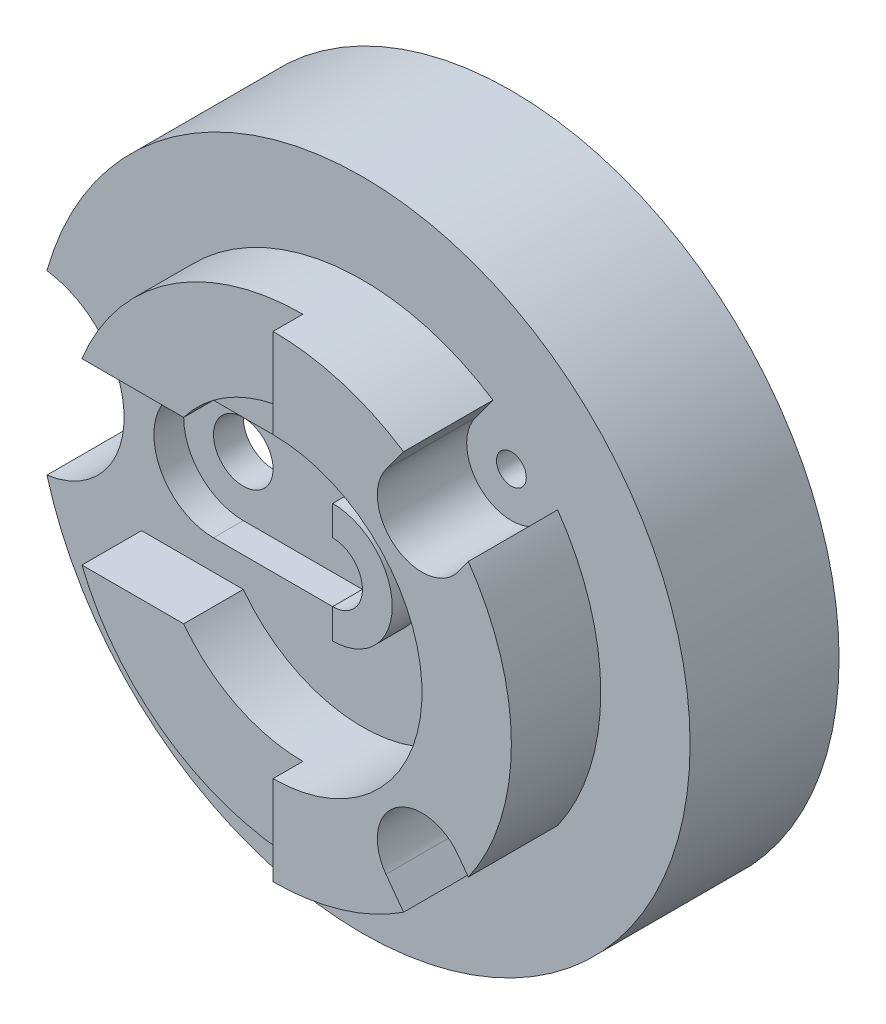
ISO-10303-21;
HEADER;
FILE_DESCRIPTION(('STEP AP214'),'2;1');
FILE_NAME('part.step','',(''),(''),'','','');
FILE_SCHEMA(('AUTOMOTIVE_DESIGN { 1 0 10303 214 1 1 1 1 }'));
ENDSEC;
DATA;
#1=APPLICATION_CONTEXT('core data for automotive mechanical design processes');
#2=APPLICATION_PROTOCOL_DEFINITION('international standard','automotive_design',2000,#1);
#3=PRODUCT_CONTEXT('',#1,'mechanical');
#4=PRODUCT('Part','Part','',(#3));
#5=PRODUCT_RELATED_PRODUCT_CATEGORY('part','',(#4));
#6=PRODUCT_DEFINITION_FORMATION('','',#4);
#7=PRODUCT_DEFINITION_CONTEXT('part definition',#1,'design');
#8=PRODUCT_DEFINITION('design','',#6,#7);
#9=PRODUCT_DEFINITION_SHAPE('','',#8);
#10=(LENGTH_UNIT() NAMED_UNIT(*) SI_UNIT(.MILLI.,.METRE.));
#11=(NAMED_UNIT(*) PLANE_ANGLE_UNIT() SI_UNIT($,.RADIAN.));
#12=(NAMED_UNIT(*) SI_UNIT($,.STERADIAN.) SOLID_ANGLE_UNIT());
#13=UNCERTAINTY_MEASURE_WITH_UNIT(LENGTH_MEASURE(1.E-05),#10,'distance_accuracy_value','');
#14=(GEOMETRIC_REPRESENTATION_CONTEXT(3) GLOBAL_UNCERTAINTY_ASSIGNED_CONTEXT((#13)) GLOBAL_UNIT_ASSIGNED_CONTEXT((#10,
#11,#12)) REPRESENTATION_CONTEXT('',''));
#15=CARTESIAN_POINT('',(0.,0.,0.));
#16=DIRECTION('',(0.,0.,1.));
#17=DIRECTION('',(1.,0.,0.));
#18=AXIS2_PLACEMENT_3D('',#15,#16,#17);
#19=CARTESIAN_POINT('',(0.,0.,70.));
#20=DIRECTION('',(0.,0.,-1.));
#21=DIRECTION('',(-1.,0.,0.));
#22=AXIS2_PLACEMENT_3D('',#19,#20,#21);
#23=CYLINDRICAL_SURFACE('',#22,80.);
#24=DIRECTION('',(0.,0.,1.));
#25=VECTOR('',#24,1.);
#26=CARTESIAN_POINT('',(43.8160478416078,66.9339521583922,50.));
#27=LINE('',#26,#25);
#28=CARTESIAN_POINT('',(43.8160478416078,66.9339521583922,50.));
#29=VERTEX_POINT('',#28);
#30=CARTESIAN_POINT('',(43.8160478416078,66.9339521583922,80.));
#31=VERTEX_POINT('',#30);
#32=EDGE_CURVE('E245',#29,#31,#27,.T.);
#33=ORIENTED_EDGE('',*,*,#32,.F.);
#34=CARTESIAN_POINT('',(0.,0.,50.));
#35=DIRECTION('',(0.,0.,1.));
#36=DIRECTION('',(1.,0.,0.));
#37=AXIS2_PLACEMENT_3D('',#34,#35,#36);
#38=CIRCLE('',#37,80.);
#39=CARTESIAN_POINT('',(-74.1619848709566,30.,50.));
#40=VERTEX_POINT('',#39);
#41=EDGE_CURVE('E232',#29,#40,#38,.T.);
#42=ORIENTED_EDGE('',*,*,#41,.T.);
#43=DIRECTION('',(0.,0.,-1.));
#44=VECTOR('',#43,1.);
#45=CARTESIAN_POINT('',(-74.1619848709566,30.,70.));
#46=LINE('',#45,#44);
#47=CARTESIAN_POINT('',(-74.1619848709566,30.,70.));
#48=VERTEX_POINT('',#47);
#49=EDGE_CURVE('E336',#48,#40,#46,.T.);
#50=ORIENTED_EDGE('',*,*,#49,.F.);
#51=CARTESIAN_POINT('',(0.,0.,70.));
#52=DIRECTION('',(0.,0.,1.));
#53=DIRECTION('',(1.,0.,0.));
#54=AXIS2_PLACEMENT_3D('',#51,#52,#53);
#55=CIRCLE('',#54,80.);
#56=CARTESIAN_POINT('',(0.,80.,70.));
#57=VERTEX_POINT('',#56);
#58=EDGE_CURVE('E323',#57,#48,#55,.T.);
#59=ORIENTED_EDGE('',*,*,#58,.F.);
#60=DIRECTION('',(0.,0.,-1.));
#61=VECTOR('',#60,1.);
#62=CARTESIAN_POINT('',(0.,80.,80.));
#63=LINE('',#62,#61);
#64=CARTESIAN_POINT('',(0.,80.,80.));
#65=VERTEX_POINT('',#64);
#66=EDGE_CURVE('E293',#65,#57,#63,.T.);
#67=ORIENTED_EDGE('',*,*,#66,.F.);
#68=CARTESIAN_POINT('',(0.,0.,80.));
#69=DIRECTION('',(0.,0.,1.));
#70=DIRECTION('',(-1.,0.,0.));
#71=AXIS2_PLACEMENT_3D('',#68,#69,#70);
#72=CIRCLE('',#71,80.);
#73=EDGE_CURVE('E268',#31,#65,#72,.T.);
#74=ORIENTED_EDGE('',*,*,#73,.F.);
#75=EDGE_LOOP('',(#33,#42,#50,#59,#67,#74));
#76=FACE_BOUND('',#75,.T.);
#77=ADVANCED_FACE('F35',(#76),#23,.T.);
#78=CARTESIAN_POINT('',(0.,0.,80.));
#79=DIRECTION('',(0.,0.,-1.));
#80=DIRECTION('',(-1.,0.,0.));
#81=AXIS2_PLACEMENT_3D('',#78,#79,#80);
#82=PLANE('',#81);
#83=DIRECTION('',(0.591291571667573,0.806457858337862,0.));
#84=VECTOR('',#83,1.);
#85=CARTESIAN_POINT('',(-3.42074073833633,2.50807298425605,80.));
#86=LINE('',#85,#84);
#87=CARTESIAN_POINT('',(37.903132124932,58.8693735750136,80.));
#88=VERTEX_POINT('',#87);
#89=EDGE_CURVE('E220',#88,#31,#86,.T.);
#90=ORIENTED_EDGE('',*,*,#89,.T.);
#91=ORIENTED_EDGE('',*,*,#73,.T.);
#92=DIRECTION('',(0.,-1.,0.));
#93=VECTOR('',#92,1.);
#94=CARTESIAN_POINT('',(0.,80.,80.));
#95=LINE('',#94,#93);
#96=CARTESIAN_POINT('',(0.,50.,80.));
#97=VERTEX_POINT('',#96);
#98=EDGE_CURVE('E278',#65,#97,#95,.T.);
#99=ORIENTED_EDGE('',*,*,#98,.T.);
#100=CARTESIAN_POINT('',(0.,0.,80.));
#101=DIRECTION('',(0.,0.,-1.));
#102=DIRECTION('',(-1.,0.,0.));
#103=AXIS2_PLACEMENT_3D('',#100,#101,#102);
#104=CIRCLE('',#103,50.);
#105=CARTESIAN_POINT('',(0.,-50.,80.));
#106=VERTEX_POINT('',#105);
#107=EDGE_CURVE('E281',#97,#106,#104,.T.);
#108=ORIENTED_EDGE('',*,*,#107,.T.);
#109=DIRECTION('',(0.,-1.,0.));
#110=VECTOR('',#109,1.);
#111=CARTESIAN_POINT('',(0.,-50.,80.));
#112=LINE('',#111,#110);
#113=CARTESIAN_POINT('',(0.,-80.,80.));
#114=VERTEX_POINT('',#113);
#115=EDGE_CURVE('E283',#106,#114,#112,.T.);
#116=ORIENTED_EDGE('',*,*,#115,.T.);
#117=CARTESIAN_POINT('',(43.8160478416078,-66.9339521583922,80.));
#118=VERTEX_POINT('',#117);
#119=EDGE_CURVE('E275',#114,#118,#72,.T.);
#120=ORIENTED_EDGE('',*,*,#119,.T.);
#121=DIRECTION('',(0.591291571667574,-0.806457858337862,0.));
#122=VECTOR('',#121,1.);
#123=CARTESIAN_POINT('',(-3.42074073833641,-2.50807298425611,80.));
#124=LINE('',#123,#122);
#125=CARTESIAN_POINT('',(37.903132124932,-58.8693735750136,80.));
#126=VERTEX_POINT('',#125);
#127=EDGE_CURVE('E254',#126,#118,#124,.T.);
#128=ORIENTED_EDGE('',*,*,#127,.F.);
#129=CARTESIAN_POINT('',(50.,-50.,80.));
#130=DIRECTION('',(0.,0.,1.));
#131=DIRECTION('',(1.,0.,0.));
#132=AXIS2_PLACEMENT_3D('',#129,#130,#131);
#133=CIRCLE('',#132,15.);
#134=CARTESIAN_POINT('',(62.0968678750679,-41.1306264249864,80.));
#135=VERTEX_POINT('',#134);
#136=EDGE_CURVE('E262',#135,#126,#133,.T.);
#137=ORIENTED_EDGE('',*,*,#136,.F.);
#138=DIRECTION('',(0.591291571667573,-0.806457858337863,0.));
#139=VECTOR('',#138,1.);
#140=CARTESIAN_POINT('',(20.7729950117996,15.2306741657711,80.));
#141=LINE('',#140,#139);
#142=CARTESIAN_POINT('',(65.5572689246008,-45.8502398155951,80.));
#143=VERTEX_POINT('',#142);
#144=EDGE_CURVE('E58',#135,#143,#141,.T.);
#145=ORIENTED_EDGE('',*,*,#144,.T.);
#146=CARTESIAN_POINT('',(65.5313131174542,45.8873294178488,80.));
#147=VERTEX_POINT('',#146);
#148=EDGE_CURVE('E279',#143,#147,#72,.T.);
#149=ORIENTED_EDGE('',*,*,#148,.T.);
#150=DIRECTION('',(0.591291571667573,0.806457858337862,0.));
#151=VECTOR('',#150,1.);
#152=CARTESIAN_POINT('',(20.7384277813175,-15.2053296151184,80.));
#153=LINE('',#152,#151);
#154=CARTESIAN_POINT('',(61.3922721157812,40.2421244094837,80.));
#155=VERTEX_POINT('',#154);
#156=EDGE_CURVE('E233',#155,#147,#153,.T.);
#157=ORIENTED_EDGE('',*,*,#156,.F.);
#158=CARTESIAN_POINT('',(50.,50.,80.));
#159=DIRECTION('',(0.,0.,1.));
#160=DIRECTION('',(1.,0.,0.));
#161=AXIS2_PLACEMENT_3D('',#158,#159,#160);
#162=CIRCLE('',#161,15.);
#163=EDGE_CURVE('E241',#88,#155,#162,.T.);
#164=ORIENTED_EDGE('',*,*,#163,.F.);
#165=EDGE_LOOP('',(#90,#91,#99,#108,#116,#120,#128,#137,#145,#149,#157,#164));
#166=FACE_BOUND('',#165,.T.);
#167=ADVANCED_FACE('F518',(#166),#82,.F.);
#168=CARTESIAN_POINT('',(65.5572689246008,-45.8502398155951,50.));
#169=VERTEX_POINT('',#168);
#170=CARTESIAN_POINT('',(65.5313131174542,45.8873294178488,50.));
#171=VERTEX_POINT('',#170);
#172=EDGE_CURVE('E332',#169,#171,#38,.T.);
#173=ORIENTED_EDGE('',*,*,#172,.T.);
#174=DIRECTION('',(0.,0.,1.));
#175=VECTOR('',#174,1.);
#176=CARTESIAN_POINT('',(65.5313131174542,45.8873294178488,50.));
#177=LINE('',#176,#175);
#178=EDGE_CURVE('E247',#171,#147,#177,.T.);
#179=ORIENTED_EDGE('',*,*,#178,.T.);
#180=ORIENTED_EDGE('',*,*,#148,.F.);
#181=DIRECTION('',(0.,0.,1.));
#182=VECTOR('',#181,1.);
#183=CARTESIAN_POINT('',(65.5572689246008,-45.8502398155951,50.));
#184=LINE('',#183,#182);
#185=EDGE_CURVE('E266',#169,#143,#184,.T.);
#186=ORIENTED_EDGE('',*,*,#185,.F.);
#187=EDGE_LOOP('',(#173,#179,#180,#186));
#188=FACE_BOUND('',#187,.T.);
#189=ADVANCED_FACE('F462',(#188),#23,.T.);
#190=CARTESIAN_POINT('',(0.,0.,50.));
#191=DIRECTION('',(0.,0.,1.));
#192=DIRECTION('',(1.,0.,0.));
#193=AXIS2_PLACEMENT_3D('',#190,#191,#192);
#194=PLANE('',#193);
#195=CARTESIAN_POINT('',(0.,0.,50.));
#196=DIRECTION('',(0.,0.,1.));
#197=DIRECTION('',(1.,0.,0.));
#198=AXIS2_PLACEMENT_3D('',#195,#196,#197);
#199=CIRCLE('',#198,110.);
#200=CARTESIAN_POINT('',(-105.909090909091,-29.7197655241409,50.));
#201=VERTEX_POINT('',#200);
#202=CARTESIAN_POINT('',(-105.909090909091,29.7197655241409,50.));
#203=VERTEX_POINT('',#202);
#204=EDGE_CURVE('E436',#201,#203,#199,.T.);
#205=ORIENTED_EDGE('',*,*,#204,.T.);
#206=CARTESIAN_POINT('',(-110.,0.,50.));
#207=DIRECTION('',(0.,0.,1.));
#208=DIRECTION('',(1.,0.,0.));
#209=AXIS2_PLACEMENT_3D('',#206,#207,#208);
#210=CIRCLE('',#209,30.);
#211=EDGE_CURVE('E339',#203,#201,#210,.F.);
#212=ORIENTED_EDGE('',*,*,#211,.T.);
#213=EDGE_LOOP('',(#205,#212));
#214=FACE_BOUND('',#213,.T.);
#215=CARTESIAN_POINT('',(35.,0.,50.));
#216=DIRECTION('',(0.,0.,1.));
#217=DIRECTION('',(1.,0.,0.));
#218=AXIS2_PLACEMENT_3D('',#215,#216,#217);
#219=CIRCLE('',#218,5.);
#220=CARTESIAN_POINT('',(40.,0.,50.));
#221=VERTEX_POINT('',#220);
#222=EDGE_CURVE('E412',#221,#221,#219,.T.);
#223=ORIENTED_EDGE('',*,*,#222,.F.);
#224=EDGE_LOOP('',(#223));
#225=FACE_BOUND('',#224,.T.);
#226=DIRECTION('',(1.,0.,0.));
#227=VECTOR('',#226,1.);
#228=CARTESIAN_POINT('',(0.,20.,50.));
#229=LINE('',#228,#227);
#230=CARTESIAN_POINT('',(-50.,20.,50.));
#231=VERTEX_POINT('',#230);
#232=CARTESIAN_POINT('',(0.,20.,50.));
#233=VERTEX_POINT('',#232);
#234=EDGE_CURVE('E402',#231,#233,#229,.T.);
#235=ORIENTED_EDGE('',*,*,#234,.T.);
#236=CARTESIAN_POINT('',(0.,0.,50.));
#237=DIRECTION('',(0.,0.,1.));
#238=DIRECTION('',(1.,0.,0.));
#239=AXIS2_PLACEMENT_3D('',#236,#237,#238);
#240=CIRCLE('',#239,20.);
#241=CARTESIAN_POINT('',(0.,-20.,50.));
#242=VERTEX_POINT('',#241);
#243=EDGE_CURVE('E384',#233,#242,#240,.F.);
#244=ORIENTED_EDGE('',*,*,#243,.T.);
#245=DIRECTION('',(1.,0.,0.));
#246=VECTOR('',#245,1.);
#247=CARTESIAN_POINT('',(0.,-20.,50.));
#248=LINE('',#247,#246);
#249=CARTESIAN_POINT('',(-50.,-20.,50.));
#250=VERTEX_POINT('',#249);
#251=EDGE_CURVE('E389',#250,#242,#248,.T.);
#252=ORIENTED_EDGE('',*,*,#251,.F.);
#253=CARTESIAN_POINT('',(-50.,0.,50.));
#254=DIRECTION('',(0.,0.,1.));
#255=DIRECTION('',(1.,0.,0.));
#256=AXIS2_PLACEMENT_3D('',#253,#254,#255);
#257=CIRCLE('',#256,20.);
#258=EDGE_CURVE('E405',#231,#250,#257,.T.);
#259=ORIENTED_EDGE('',*,*,#258,.F.);
#260=EDGE_LOOP('',(#235,#244,#252,#259));
#261=FACE_BOUND('',#260,.T.);
#262=CARTESIAN_POINT('',(-74.1619848709566,-30.,50.));
#263=VERTEX_POINT('',#262);
#264=CARTESIAN_POINT('',(43.8160478416078,-66.9339521583922,50.));
#265=VERTEX_POINT('',#264);
#266=EDGE_CURVE('E329',#263,#265,#38,.T.);
#267=ORIENTED_EDGE('',*,*,#266,.F.);
#268=DIRECTION('',(-1.,0.,0.));
#269=VECTOR('',#268,1.);
#270=CARTESIAN_POINT('',(-40.,-30.,50.));
#271=LINE('',#270,#269);
#272=CARTESIAN_POINT('',(-40.,-30.,50.));
#273=VERTEX_POINT('',#272);
#274=EDGE_CURVE('E295',#273,#263,#271,.T.);
#275=ORIENTED_EDGE('',*,*,#274,.F.);
#276=CARTESIAN_POINT('',(0.,0.,50.));
#277=DIRECTION('',(0.,0.,-1.));
#278=DIRECTION('',(1.,0.,0.));
#279=AXIS2_PLACEMENT_3D('',#276,#277,#278);
#280=CIRCLE('',#279,50.);
#281=CARTESIAN_POINT('',(-40.,30.,50.));
#282=VERTEX_POINT('',#281);
#283=EDGE_CURVE('E315',#282,#273,#280,.T.);
#284=ORIENTED_EDGE('',*,*,#283,.F.);
#285=DIRECTION('',(1.,0.,0.));
#286=VECTOR('',#285,1.);
#287=CARTESIAN_POINT('',(-74.1619848709566,30.,50.));
#288=LINE('',#287,#286);
#289=EDGE_CURVE('E320',#40,#282,#288,.T.);
#290=ORIENTED_EDGE('',*,*,#289,.F.);
#291=ORIENTED_EDGE('',*,*,#41,.F.);
#292=DIRECTION('',(0.591291571667573,0.806457858337862,0.));
#293=VECTOR('',#292,1.);
#294=CARTESIAN_POINT('',(-3.42074073833633,2.50807298425605,50.));
#295=LINE('',#294,#293);
#296=CARTESIAN_POINT('',(37.903132124932,58.8693735750136,50.));
#297=VERTEX_POINT('',#296);
#298=EDGE_CURVE('E217',#297,#29,#295,.T.);
#299=ORIENTED_EDGE('',*,*,#298,.F.);
#300=CARTESIAN_POINT('',(50.,50.,50.));
#301=DIRECTION('',(0.,0.,1.));
#302=DIRECTION('',(1.,0.,0.));
#303=AXIS2_PLACEMENT_3D('',#300,#301,#302);
#304=CIRCLE('',#303,15.);
#305=CARTESIAN_POINT('',(61.3922721157812,40.2421244094837,50.));
#306=VERTEX_POINT('',#305);
#307=EDGE_CURVE('E230',#297,#306,#304,.T.);
#308=ORIENTED_EDGE('',*,*,#307,.T.);
#309=DIRECTION('',(0.591291571667573,0.806457858337862,0.));
#310=VECTOR('',#309,1.);
#311=CARTESIAN_POINT('',(20.7384277813175,-15.2053296151184,50.));
#312=LINE('',#311,#310);
#313=EDGE_CURVE('E50',#306,#171,#312,.T.);
#314=ORIENTED_EDGE('',*,*,#313,.T.);
#315=ORIENTED_EDGE('',*,*,#172,.F.);
#316=DIRECTION('',(0.591291571667573,-0.806457858337863,0.));
#317=VECTOR('',#316,1.);
#318=CARTESIAN_POINT('',(20.7729950117996,15.2306741657711,50.));
#319=LINE('',#318,#317);
#320=CARTESIAN_POINT('',(62.0968678750679,-41.1306264249864,50.));
#321=VERTEX_POINT('',#320);
#322=EDGE_CURVE('E251',#321,#169,#319,.T.);
#323=ORIENTED_EDGE('',*,*,#322,.F.);
#324=CARTESIAN_POINT('',(50.,-50.,50.));
#325=DIRECTION('',(0.,0.,1.));
#326=DIRECTION('',(1.,0.,0.));
#327=AXIS2_PLACEMENT_3D('',#324,#325,#326);
#328=CIRCLE('',#327,15.);
#329=CARTESIAN_POINT('',(37.903132124932,-58.8693735750136,50.));
#330=VERTEX_POINT('',#329);
#331=EDGE_CURVE('E253',#321,#330,#328,.T.);
#332=ORIENTED_EDGE('',*,*,#331,.T.);
#333=DIRECTION('',(0.591291571667574,-0.806457858337862,0.));
#334=VECTOR('',#333,1.);
#335=CARTESIAN_POINT('',(-3.42074073833641,-2.50807298425611,50.));
#336=LINE('',#335,#334);
#337=EDGE_CURVE('E257',#330,#265,#336,.T.);
#338=ORIENTED_EDGE('',*,*,#337,.T.);
#339=EDGE_LOOP('',(#267,#275,#284,#290,#291,#299,#308,#314,#315,#323,#332,#338));
#340=FACE_BOUND('',#339,.T.);
#341=CARTESIAN_POINT('',(50.,-50.,50.));
#342=DIRECTION('',(0.,0.,1.));
#343=DIRECTION('',(1.,0.,0.));
#344=AXIS2_PLACEMENT_3D('',#341,#342,#343);
#345=CIRCLE('',#344,5.);
#346=CARTESIAN_POINT('',(55.,-50.,50.));
#347=VERTEX_POINT('',#346);
#348=EDGE_CURVE('E624',#347,#347,#345,.T.);
#349=ORIENTED_EDGE('',*,*,#348,.F.);
#350=EDGE_LOOP('',(#349));
#351=FACE_BOUND('',#350,.T.);
#352=CARTESIAN_POINT('',(50.,50.,50.));
#353=DIRECTION('',(0.,0.,1.));
#354=DIRECTION('',(1.,0.,0.));
#355=AXIS2_PLACEMENT_3D('',#352,#353,#354);
#356=CIRCLE('',#355,5.);
#357=CARTESIAN_POINT('',(55.,50.,50.));
#358=VERTEX_POINT('',#357);
#359=EDGE_CURVE('E242',#358,#358,#356,.T.);
#360=ORIENTED_EDGE('',*,*,#359,.F.);
#361=EDGE_LOOP('',(#360));
#362=FACE_BOUND('',#361,.T.);
#363=ADVANCED_FACE('F228',(#214,#225,#261,#340,#351,#362),#194,.T.);
#364=CARTESIAN_POINT('',(0.,0.,50.));
#365=DIRECTION('',(0.,0.,-1.));
#366=DIRECTION('',(-1.,0.,0.));
#367=AXIS2_PLACEMENT_3D('',#364,#365,#366);
#368=CYLINDRICAL_SURFACE('',#367,110.);
#369=CARTESIAN_POINT('',(0.,0.,0.));
#370=DIRECTION('',(0.,0.,1.));
#371=DIRECTION('',(1.,0.,0.));
#372=AXIS2_PLACEMENT_3D('',#369,#370,#371);
#373=CIRCLE('',#372,110.);
#374=CARTESIAN_POINT('',(110.,0.,0.));
#375=VERTEX_POINT('',#374);
#376=EDGE_CURVE('E433',#375,#375,#373,.T.);
#377=ORIENTED_EDGE('',*,*,#376,.T.);
#378=EDGE_LOOP('',(#377));
#379=FACE_BOUND('',#378,.T.);
#380=DIRECTION('',(0.,0.,1.));
#381=VECTOR('',#380,1.);
#382=CARTESIAN_POINT('',(-105.909090909091,29.7197655241409,20.));
#383=LINE('',#382,#381);
#384=CARTESIAN_POINT('',(-105.909090909091,29.7197655241409,20.));
#385=VERTEX_POINT('',#384);
#386=EDGE_CURVE('E347',#385,#203,#383,.T.);
#387=ORIENTED_EDGE('',*,*,#386,.T.);
#388=ORIENTED_EDGE('',*,*,#204,.F.);
#389=DIRECTION('',(0.,0.,1.));
#390=VECTOR('',#389,1.);
#391=CARTESIAN_POINT('',(-105.909090909091,-29.7197655241409,20.));
#392=LINE('',#391,#390);
#393=CARTESIAN_POINT('',(-105.909090909091,-29.7197655241409,20.));
#394=VERTEX_POINT('',#393);
#395=EDGE_CURVE('E350',#394,#201,#392,.T.);
#396=ORIENTED_EDGE('',*,*,#395,.F.);
#397=CARTESIAN_POINT('',(0.,0.,20.));
#398=DIRECTION('',(0.,0.,1.));
#399=DIRECTION('',(1.,0.,0.));
#400=AXIS2_PLACEMENT_3D('',#397,#398,#399);
#401=CIRCLE('',#400,110.);
#402=EDGE_CURVE('E343',#385,#394,#401,.T.);
#403=ORIENTED_EDGE('',*,*,#402,.F.);
#404=EDGE_LOOP('',(#387,#388,#396,#403));
#405=FACE_BOUND('',#404,.T.);
#406=ADVANCED_FACE('F37',(#379,#405),#368,.T.);
#407=CARTESIAN_POINT('',(0.,0.,30.));
#408=DIRECTION('',(0.,0.,-1.));
#409=DIRECTION('',(-1.,0.,0.));
#410=AXIS2_PLACEMENT_3D('',#407,#408,#409);
#411=CYLINDRICAL_SURFACE('',#410,100.);
#412=CARTESIAN_POINT('',(0.,0.,0.));
#413=DIRECTION('',(0.,0.,-1.));
#414=DIRECTION('',(-1.,0.,0.));
#415=AXIS2_PLACEMENT_3D('',#412,#413,#414);
#416=CIRCLE('',#415,100.);
#417=CARTESIAN_POINT('',(-100.,0.,0.));
#418=VERTEX_POINT('',#417);
#419=EDGE_CURVE('E429',#418,#418,#416,.T.);
#420=ORIENTED_EDGE('',*,*,#419,.T.);
#421=EDGE_LOOP('',(#420));
#422=FACE_BOUND('',#421,.T.);
#423=DIRECTION('',(0.,0.,1.));
#424=VECTOR('',#423,1.);
#425=CARTESIAN_POINT('',(-96.3636363636364,26.7217062849074,35.));
#426=LINE('',#425,#424);
#427=CARTESIAN_POINT('',(-96.3636363636364,26.7217062849074,20.));
#428=VERTEX_POINT('',#427);
#429=CARTESIAN_POINT('',(-96.3636363636364,26.7217062849074,30.));
#430=VERTEX_POINT('',#429);
#431=EDGE_CURVE('E356',#428,#430,#426,.T.);
#432=ORIENTED_EDGE('',*,*,#431,.F.);
#433=CARTESIAN_POINT('',(0.,0.,20.));
#434=DIRECTION('',(0.,0.,1.));
#435=DIRECTION('',(1.,0.,0.));
#436=AXIS2_PLACEMENT_3D('',#433,#434,#435);
#437=CIRCLE('',#436,100.);
#438=CARTESIAN_POINT('',(-96.3636363636364,-26.7217062849074,20.));
#439=VERTEX_POINT('',#438);
#440=EDGE_CURVE('E11',#439,#428,#437,.F.);
#441=ORIENTED_EDGE('',*,*,#440,.F.);
#442=DIRECTION('',(0.,0.,1.));
#443=VECTOR('',#442,1.);
#444=CARTESIAN_POINT('',(-96.3636363636364,-26.7217062849074,35.));
#445=LINE('',#444,#443);
#446=CARTESIAN_POINT('',(-96.3636363636364,-26.7217062849074,30.));
#447=VERTEX_POINT('',#446);
#448=EDGE_CURVE('E352',#447,#439,#445,.F.);
#449=ORIENTED_EDGE('',*,*,#448,.F.);
#450=CARTESIAN_POINT('',(0.,0.,30.));
#451=DIRECTION('',(0.,0.,-1.));
#452=DIRECTION('',(-1.,0.,0.));
#453=AXIS2_PLACEMENT_3D('',#450,#451,#452);
#454=CIRCLE('',#453,100.);
#455=EDGE_CURVE('E430',#430,#447,#454,.T.);
#456=ORIENTED_EDGE('',*,*,#455,.F.);
#457=EDGE_LOOP('',(#432,#441,#449,#456));
#458=FACE_BOUND('',#457,.T.);
#459=ADVANCED_FACE('F448',(#422,#458),#411,.F.);
#460=CARTESIAN_POINT('',(0.,0.,30.));
#461=DIRECTION('',(0.,0.,-1.));
#462=DIRECTION('',(-1.,0.,0.));
#463=AXIS2_PLACEMENT_3D('',#460,#461,#462);
#464=PLANE('',#463);
#465=CARTESIAN_POINT('',(50.,-50.,30.));
#466=DIRECTION('',(0.,0.,1.));
#467=DIRECTION('',(1.,0.,0.));
#468=AXIS2_PLACEMENT_3D('',#465,#466,#467);
#469=CIRCLE('',#468,5.);
#470=CARTESIAN_POINT('',(55.,-50.,30.));
#471=VERTEX_POINT('',#470);
#472=EDGE_CURVE('E627',#471,#471,#469,.T.);
#473=ORIENTED_EDGE('',*,*,#472,.T.);
#474=EDGE_LOOP('',(#473));
#475=FACE_BOUND('',#474,.T.);
#476=CARTESIAN_POINT('',(50.,50.,30.));
#477=DIRECTION('',(0.,0.,1.));
#478=DIRECTION('',(1.,0.,0.));
#479=AXIS2_PLACEMENT_3D('',#476,#477,#478);
#480=CIRCLE('',#479,5.);
#481=CARTESIAN_POINT('',(55.,50.,30.));
#482=VERTEX_POINT('',#481);
#483=EDGE_CURVE('E629',#482,#482,#480,.T.);
#484=ORIENTED_EDGE('',*,*,#483,.T.);
#485=EDGE_LOOP('',(#484));
#486=FACE_BOUND('',#485,.T.);
#487=CARTESIAN_POINT('',(0.,0.,30.));
#488=DIRECTION('',(0.,0.,1.));
#489=DIRECTION('',(1.,0.,0.));
#490=AXIS2_PLACEMENT_3D('',#487,#488,#489);
#491=CIRCLE('',#490,10.);
#492=CARTESIAN_POINT('',(10.,0.,30.));
#493=VERTEX_POINT('',#492);
#494=EDGE_CURVE('E426',#493,#493,#491,.T.);
#495=ORIENTED_EDGE('',*,*,#494,.T.);
#496=EDGE_LOOP('',(#495));
#497=FACE_BOUND('',#496,.T.);
#498=CARTESIAN_POINT('',(-50.,0.,30.));
#499=DIRECTION('',(0.,0.,1.));
#500=DIRECTION('',(1.,0.,0.));
#501=AXIS2_PLACEMENT_3D('',#498,#499,#500);
#502=CIRCLE('',#501,10.);
#503=CARTESIAN_POINT('',(-40.,0.,30.));
#504=VERTEX_POINT('',#503);
#505=EDGE_CURVE('E421',#504,#504,#502,.T.);
#506=ORIENTED_EDGE('',*,*,#505,.T.);
#507=EDGE_LOOP('',(#506));
#508=FACE_BOUND('',#507,.T.);
#509=CARTESIAN_POINT('',(35.,0.,30.));
#510=DIRECTION('',(0.,0.,1.));
#511=DIRECTION('',(1.,0.,0.));
#512=AXIS2_PLACEMENT_3D('',#509,#510,#511);
#513=CIRCLE('',#512,5.);
#514=CARTESIAN_POINT('',(40.,0.,30.));
#515=VERTEX_POINT('',#514);
#516=EDGE_CURVE('E418',#515,#515,#513,.T.);
#517=ORIENTED_EDGE('',*,*,#516,.T.);
#518=EDGE_LOOP('',(#517));
#519=FACE_BOUND('',#518,.T.);
#520=ORIENTED_EDGE('',*,*,#455,.T.);
#521=CARTESIAN_POINT('',(-110.,0.,30.));
#522=DIRECTION('',(0.,0.,-1.));
#523=DIRECTION('',(-1.,0.,0.));
#524=AXIS2_PLACEMENT_3D('',#521,#522,#523);
#525=CIRCLE('',#524,30.);
#526=EDGE_CURVE('E43',#447,#430,#525,.F.);
#527=ORIENTED_EDGE('',*,*,#526,.T.);
#528=EDGE_LOOP('',(#520,#527));
#529=FACE_BOUND('',#528,.T.);
#530=ADVANCED_FACE('F443',(#475,#486,#497,#508,#519,#529),#464,.T.);
#531=CARTESIAN_POINT('',(0.,0.,30.));
#532=DIRECTION('',(0.,0.,1.));
#533=DIRECTION('',(1.,0.,0.));
#534=AXIS2_PLACEMENT_3D('',#531,#532,#533);
#535=CYLINDRICAL_SURFACE('',#534,10.);
#536=ORIENTED_EDGE('',*,*,#494,.F.);
#537=EDGE_LOOP('',(#536));
#538=FACE_BOUND('',#537,.T.);
#539=CARTESIAN_POINT('',(0.,0.,40.));
#540=DIRECTION('',(0.,0.,1.));
#541=DIRECTION('',(1.,0.,0.));
#542=AXIS2_PLACEMENT_3D('',#539,#540,#541);
#543=CIRCLE('',#542,10.);
#544=CARTESIAN_POINT('',(0.,-10.,40.));
#545=VERTEX_POINT('',#544);
#546=CARTESIAN_POINT('',(0.,10.,40.));
#547=VERTEX_POINT('',#546);
#548=EDGE_CURVE('E397',#545,#547,#543,.F.);
#549=ORIENTED_EDGE('',*,*,#548,.F.);
#550=DIRECTION('',(0.,0.,-1.));
#551=VECTOR('',#550,1.);
#552=CARTESIAN_POINT('',(0.,-10.,60.));
#553=LINE('',#552,#551);
#554=CARTESIAN_POINT('',(0.,-10.,60.));
#555=VERTEX_POINT('',#554);
#556=EDGE_CURVE('E378',#555,#545,#553,.T.);
#557=ORIENTED_EDGE('',*,*,#556,.F.);
#558=CARTESIAN_POINT('',(0.,0.,60.));
#559=DIRECTION('',(0.,0.,1.));
#560=DIRECTION('',(1.,0.,0.));
#561=AXIS2_PLACEMENT_3D('',#558,#559,#560);
#562=CIRCLE('',#561,10.);
#563=CARTESIAN_POINT('',(0.,10.,60.));
#564=VERTEX_POINT('',#563);
#565=EDGE_CURVE('E362',#564,#555,#562,.F.);
#566=ORIENTED_EDGE('',*,*,#565,.F.);
#567=DIRECTION('',(0.,0.,-1.));
#568=VECTOR('',#567,1.);
#569=CARTESIAN_POINT('',(0.,10.,60.));
#570=LINE('',#569,#568);
#571=EDGE_CURVE('E381',#564,#547,#570,.T.);
#572=ORIENTED_EDGE('',*,*,#571,.T.);
#573=EDGE_LOOP('',(#549,#557,#566,#572));
#574=FACE_BOUND('',#573,.T.);
#575=ADVANCED_FACE('F502',(#538,#574),#535,.F.);
#576=CARTESIAN_POINT('',(-50.,0.,30.));
#577=DIRECTION('',(0.,0.,1.));
#578=DIRECTION('',(1.,0.,0.));
#579=AXIS2_PLACEMENT_3D('',#576,#577,#578);
#580=CYLINDRICAL_SURFACE('',#579,10.);
#581=ORIENTED_EDGE('',*,*,#505,.F.);
#582=EDGE_LOOP('',(#581));
#583=FACE_BOUND('',#582,.T.);
#584=CARTESIAN_POINT('',(-50.,0.,40.));
#585=DIRECTION('',(0.,0.,1.));
#586=DIRECTION('',(1.,0.,0.));
#587=AXIS2_PLACEMENT_3D('',#584,#585,#586);
#588=CIRCLE('',#587,10.);
#589=CARTESIAN_POINT('',(-40.,0.,40.));
#590=VERTEX_POINT('',#589);
#591=EDGE_CURVE('E394',#590,#590,#588,.F.);
#592=ORIENTED_EDGE('',*,*,#591,.F.);
#593=EDGE_LOOP('',(#592));
#594=FACE_BOUND('',#593,.T.);
#595=ADVANCED_FACE('F504',(#583,#594),#580,.F.);
#596=CARTESIAN_POINT('',(0.,0.,0.));
#597=DIRECTION('',(0.,0.,1.));
#598=DIRECTION('',(1.,0.,0.));
#599=AXIS2_PLACEMENT_3D('',#596,#597,#598);
#600=PLANE('',#599);
#601=ORIENTED_EDGE('',*,*,#419,.F.);
#602=EDGE_LOOP('',(#601));
#603=FACE_BOUND('',#602,.T.);
#604=ORIENTED_EDGE('',*,*,#376,.F.);
#605=EDGE_LOOP('',(#604));
#606=FACE_BOUND('',#605,.T.);
#607=ADVANCED_FACE('F511',(#603,#606),#600,.F.);
#608=CARTESIAN_POINT('',(35.,0.,30.));
#609=DIRECTION('',(0.,0.,1.));
#610=DIRECTION('',(1.,0.,0.));
#611=AXIS2_PLACEMENT_3D('',#608,#609,#610);
#612=CYLINDRICAL_SURFACE('',#611,5.);
#613=ORIENTED_EDGE('',*,*,#516,.F.);
#614=EDGE_LOOP('',(#613));
#615=FACE_BOUND('',#614,.T.);
#616=ORIENTED_EDGE('',*,*,#222,.T.);
#617=EDGE_LOOP('',(#616));
#618=FACE_BOUND('',#617,.T.);
#619=ADVANCED_FACE('F645',(#615,#618),#612,.F.);
#620=CARTESIAN_POINT('',(0.,-20.,40.));
#621=DIRECTION('',(0.,-1.,0.));
#622=DIRECTION('',(0.,0.,-1.));
#623=AXIS2_PLACEMENT_3D('',#620,#621,#622);
#624=PLANE('',#623);
#625=ORIENTED_EDGE('',*,*,#251,.T.);
#626=DIRECTION('',(0.,0.,1.));
#627=VECTOR('',#626,1.);
#628=CARTESIAN_POINT('',(0.,-20.,40.));
#629=LINE('',#628,#627);
#630=CARTESIAN_POINT('',(0.,-20.,40.));
#631=VERTEX_POINT('',#630);
#632=EDGE_CURVE('E409',#631,#242,#629,.T.);
#633=ORIENTED_EDGE('',*,*,#632,.F.);
#634=DIRECTION('',(1.,0.,0.));
#635=VECTOR('',#634,1.);
#636=CARTESIAN_POINT('',(0.,-20.,40.));
#637=LINE('',#636,#635);
#638=CARTESIAN_POINT('',(-50.,-20.,40.));
#639=VERTEX_POINT('',#638);
#640=EDGE_CURVE('E392',#639,#631,#637,.T.);
#641=ORIENTED_EDGE('',*,*,#640,.F.);
#642=DIRECTION('',(0.,0.,1.));
#643=VECTOR('',#642,1.);
#644=CARTESIAN_POINT('',(-50.,-20.,40.));
#645=LINE('',#644,#643);
#646=EDGE_CURVE('E413',#639,#250,#645,.T.);
#647=ORIENTED_EDGE('',*,*,#646,.T.);
#648=EDGE_LOOP('',(#625,#633,#641,#647));
#649=FACE_BOUND('',#648,.T.);
#650=ADVANCED_FACE('F491',(#649),#624,.F.);
#651=CARTESIAN_POINT('',(-50.,0.,40.));
#652=DIRECTION('',(0.,0.,1.));
#653=DIRECTION('',(1.,0.,0.));
#654=AXIS2_PLACEMENT_3D('',#651,#652,#653);
#655=CYLINDRICAL_SURFACE('',#654,20.);
#656=ORIENTED_EDGE('',*,*,#258,.T.);
#657=ORIENTED_EDGE('',*,*,#646,.F.);
#658=CARTESIAN_POINT('',(-50.,0.,40.));
#659=DIRECTION('',(0.,0.,1.));
#660=DIRECTION('',(1.,0.,0.));
#661=AXIS2_PLACEMENT_3D('',#658,#659,#660);
#662=CIRCLE('',#661,20.);
#663=CARTESIAN_POINT('',(-50.,20.,40.));
#664=VERTEX_POINT('',#663);
#665=EDGE_CURVE('E388',#664,#639,#662,.T.);
#666=ORIENTED_EDGE('',*,*,#665,.F.);
#667=DIRECTION('',(0.,0.,1.));
#668=VECTOR('',#667,1.);
#669=CARTESIAN_POINT('',(-50.,20.,40.));
#670=LINE('',#669,#668);
#671=EDGE_CURVE('E415',#664,#231,#670,.T.);
#672=ORIENTED_EDGE('',*,*,#671,.T.);
#673=EDGE_LOOP('',(#656,#657,#666,#672));
#674=FACE_BOUND('',#673,.T.);
#675=ADVANCED_FACE('F494',(#674),#655,.F.);
#676=CARTESIAN_POINT('',(0.,20.,40.));
#677=DIRECTION('',(0.,-1.,0.));
#678=DIRECTION('',(0.,0.,-1.));
#679=AXIS2_PLACEMENT_3D('',#676,#677,#678);
#680=PLANE('',#679);
#681=ORIENTED_EDGE('',*,*,#234,.F.);
#682=ORIENTED_EDGE('',*,*,#671,.F.);
#683=DIRECTION('',(1.,0.,0.));
#684=VECTOR('',#683,1.);
#685=CARTESIAN_POINT('',(0.,20.,40.));
#686=LINE('',#685,#684);
#687=CARTESIAN_POINT('',(0.,20.,40.));
#688=VERTEX_POINT('',#687);
#689=EDGE_CURVE('E385',#664,#688,#686,.T.);
#690=ORIENTED_EDGE('',*,*,#689,.T.);
#691=DIRECTION('',(0.,0.,1.));
#692=VECTOR('',#691,1.);
#693=CARTESIAN_POINT('',(0.,20.,40.));
#694=LINE('',#693,#692);
#695=EDGE_CURVE('E399',#688,#233,#694,.T.);
#696=ORIENTED_EDGE('',*,*,#695,.T.);
#697=EDGE_LOOP('',(#681,#682,#690,#696));
#698=FACE_BOUND('',#697,.T.);
#699=ADVANCED_FACE('F496',(#698),#680,.T.);
#700=CARTESIAN_POINT('',(0.,0.,40.));
#701=DIRECTION('',(0.,0.,1.));
#702=DIRECTION('',(1.,0.,0.));
#703=AXIS2_PLACEMENT_3D('',#700,#701,#702);
#704=PLANE('',#703);
#705=DIRECTION('',(0.,1.,0.));
#706=VECTOR('',#705,1.);
#707=CARTESIAN_POINT('',(0.,0.,40.));
#708=LINE('',#707,#706);
#709=EDGE_CURVE('E358',#547,#688,#708,.T.);
#710=ORIENTED_EDGE('',*,*,#709,.T.);
#711=ORIENTED_EDGE('',*,*,#689,.F.);
#712=ORIENTED_EDGE('',*,*,#665,.T.);
#713=ORIENTED_EDGE('',*,*,#640,.T.);
#714=DIRECTION('',(0.,1.,0.));
#715=VECTOR('',#714,1.);
#716=CARTESIAN_POINT('',(0.,0.,40.));
#717=LINE('',#716,#715);
#718=EDGE_CURVE('E363',#631,#545,#717,.T.);
#719=ORIENTED_EDGE('',*,*,#718,.T.);
#720=ORIENTED_EDGE('',*,*,#548,.T.);
#721=EDGE_LOOP('',(#710,#711,#712,#713,#719,#720));
#722=FACE_BOUND('',#721,.T.);
#723=ORIENTED_EDGE('',*,*,#591,.T.);
#724=EDGE_LOOP('',(#723));
#725=FACE_BOUND('',#724,.T.);
#726=ADVANCED_FACE('F498',(#722,#725),#704,.T.);
#727=CARTESIAN_POINT('',(0.,0.,60.));
#728=DIRECTION('',(-1.,0.,0.));
#729=DIRECTION('',(0.,-1.,0.));
#730=AXIS2_PLACEMENT_3D('',#727,#728,#729);
#731=PLANE('',#730);
#732=ORIENTED_EDGE('',*,*,#709,.F.);
#733=ORIENTED_EDGE('',*,*,#571,.F.);
#734=DIRECTION('',(0.,1.,0.));
#735=VECTOR('',#734,1.);
#736=CARTESIAN_POINT('',(0.,0.,60.));
#737=LINE('',#736,#735);
#738=CARTESIAN_POINT('',(0.,20.,60.));
#739=VERTEX_POINT('',#738);
#740=EDGE_CURVE('E359',#564,#739,#737,.T.);
#741=ORIENTED_EDGE('',*,*,#740,.T.);
#742=DIRECTION('',(0.,0.,-1.));
#743=VECTOR('',#742,1.);
#744=CARTESIAN_POINT('',(0.,20.,60.));
#745=LINE('',#744,#743);
#746=EDGE_CURVE('E370',#739,#233,#745,.T.);
#747=ORIENTED_EDGE('',*,*,#746,.T.);
#748=ORIENTED_EDGE('',*,*,#695,.F.);
#749=EDGE_LOOP('',(#732,#733,#741,#747,#748));
#750=FACE_BOUND('',#749,.T.);
#751=ADVANCED_FACE('F478',(#750),#731,.T.);
#752=CARTESIAN_POINT('',(0.,0.,60.));
#753=DIRECTION('',(-1.,0.,0.));
#754=DIRECTION('',(0.,0.,1.));
#755=AXIS2_PLACEMENT_3D('',#752,#753,#754);
#756=PLANE('',#755);
#757=ORIENTED_EDGE('',*,*,#718,.F.);
#758=ORIENTED_EDGE('',*,*,#632,.T.);
#759=DIRECTION('',(0.,0.,-1.));
#760=VECTOR('',#759,1.);
#761=CARTESIAN_POINT('',(0.,-20.,60.));
#762=LINE('',#761,#760);
#763=CARTESIAN_POINT('',(0.,-20.,60.));
#764=VERTEX_POINT('',#763);
#765=EDGE_CURVE('E375',#764,#242,#762,.T.);
#766=ORIENTED_EDGE('',*,*,#765,.F.);
#767=DIRECTION('',(0.,1.,0.));
#768=VECTOR('',#767,1.);
#769=CARTESIAN_POINT('',(0.,0.,60.));
#770=LINE('',#769,#768);
#771=EDGE_CURVE('E365',#764,#555,#770,.T.);
#772=ORIENTED_EDGE('',*,*,#771,.T.);
#773=ORIENTED_EDGE('',*,*,#556,.T.);
#774=EDGE_LOOP('',(#757,#758,#766,#772,#773));
#775=FACE_BOUND('',#774,.T.);
#776=ADVANCED_FACE('F487',(#775),#756,.T.);
#777=CARTESIAN_POINT('',(0.,0.,60.));
#778=DIRECTION('',(0.,0.,-1.));
#779=DIRECTION('',(-1.,0.,0.));
#780=AXIS2_PLACEMENT_3D('',#777,#778,#779);
#781=CYLINDRICAL_SURFACE('',#780,20.);
#782=ORIENTED_EDGE('',*,*,#243,.F.);
#783=ORIENTED_EDGE('',*,*,#746,.F.);
#784=CARTESIAN_POINT('',(0.,0.,60.));
#785=DIRECTION('',(0.,0.,1.));
#786=DIRECTION('',(1.,0.,0.));
#787=AXIS2_PLACEMENT_3D('',#784,#785,#786);
#788=CIRCLE('',#787,20.);
#789=EDGE_CURVE('E368',#764,#739,#788,.T.);
#790=ORIENTED_EDGE('',*,*,#789,.F.);
#791=ORIENTED_EDGE('',*,*,#765,.T.);
#792=EDGE_LOOP('',(#782,#783,#790,#791));
#793=FACE_BOUND('',#792,.T.);
#794=ADVANCED_FACE('F473',(#793),#781,.T.);
#795=CARTESIAN_POINT('',(0.,0.,60.));
#796=DIRECTION('',(0.,0.,1.));
#797=DIRECTION('',(1.,0.,0.));
#798=AXIS2_PLACEMENT_3D('',#795,#796,#797);
#799=PLANE('',#798);
#800=ORIENTED_EDGE('',*,*,#740,.F.);
#801=ORIENTED_EDGE('',*,*,#565,.T.);
#802=ORIENTED_EDGE('',*,*,#771,.F.);
#803=ORIENTED_EDGE('',*,*,#789,.T.);
#804=EDGE_LOOP('',(#800,#801,#802,#803));
#805=FACE_BOUND('',#804,.T.);
#806=ADVANCED_FACE('F482',(#805),#799,.T.);
#807=CARTESIAN_POINT('',(0.,0.,20.));
#808=DIRECTION('',(0.,0.,1.));
#809=DIRECTION('',(1.,0.,0.));
#810=AXIS2_PLACEMENT_3D('',#807,#808,#809);
#811=PLANE('',#810);
#812=ORIENTED_EDGE('',*,*,#440,.T.);
#813=CARTESIAN_POINT('',(-110.,0.,20.));
#814=DIRECTION('',(0.,0.,1.));
#815=DIRECTION('',(1.,0.,0.));
#816=AXIS2_PLACEMENT_3D('',#813,#814,#815);
#817=CIRCLE('',#816,30.);
#818=EDGE_CURVE('E340',#385,#428,#817,.F.);
#819=ORIENTED_EDGE('',*,*,#818,.F.);
#820=ORIENTED_EDGE('',*,*,#402,.T.);
#821=EDGE_CURVE('E344',#439,#394,#817,.F.);
#822=ORIENTED_EDGE('',*,*,#821,.F.);
#823=EDGE_LOOP('',(#812,#819,#820,#822));
#824=FACE_BOUND('',#823,.T.);
#825=ADVANCED_FACE('F453',(#824),#811,.T.);
#826=CARTESIAN_POINT('',(-110.,0.,20.));
#827=DIRECTION('',(0.,0.,1.));
#828=DIRECTION('',(1.,0.,0.));
#829=AXIS2_PLACEMENT_3D('',#826,#827,#828);
#830=CYLINDRICAL_SURFACE('',#829,30.);
#831=ORIENTED_EDGE('',*,*,#431,.T.);
#832=ORIENTED_EDGE('',*,*,#526,.F.);
#833=ORIENTED_EDGE('',*,*,#448,.T.);
#834=ORIENTED_EDGE('',*,*,#821,.T.);
#835=ORIENTED_EDGE('',*,*,#395,.T.);
#836=ORIENTED_EDGE('',*,*,#211,.F.);
#837=ORIENTED_EDGE('',*,*,#386,.F.);
#838=ORIENTED_EDGE('',*,*,#818,.T.);
#839=EDGE_LOOP('',(#831,#832,#833,#834,#835,#836,#837,#838));
#840=FACE_BOUND('',#839,.T.);
#841=ADVANCED_FACE('F451',(#840),#830,.F.);
#842=CARTESIAN_POINT('',(0.,0.,70.));
#843=DIRECTION('',(0.,0.,-1.));
#844=DIRECTION('',(-1.,0.,0.));
#845=AXIS2_PLACEMENT_3D('',#842,#843,#844);
#846=CYLINDRICAL_SURFACE('',#845,50.);
#847=ORIENTED_EDGE('',*,*,#283,.T.);
#848=DIRECTION('',(0.,0.,-1.));
#849=VECTOR('',#848,1.);
#850=CARTESIAN_POINT('',(-40.,-30.,70.));
#851=LINE('',#850,#849);
#852=CARTESIAN_POINT('',(-40.,-30.,70.));
#853=VERTEX_POINT('',#852);
#854=EDGE_CURVE('E312',#853,#273,#851,.T.);
#855=ORIENTED_EDGE('',*,*,#854,.F.);
#856=CARTESIAN_POINT('',(0.,0.,70.));
#857=DIRECTION('',(0.,0.,-1.));
#858=DIRECTION('',(-1.,0.,0.));
#859=AXIS2_PLACEMENT_3D('',#856,#857,#858);
#860=CIRCLE('',#859,50.);
#861=CARTESIAN_POINT('',(0.,-50.,70.));
#862=VERTEX_POINT('',#861);
#863=EDGE_CURVE('E296',#862,#853,#860,.T.);
#864=ORIENTED_EDGE('',*,*,#863,.F.);
#865=DIRECTION('',(0.,0.,-1.));
#866=VECTOR('',#865,1.);
#867=CARTESIAN_POINT('',(0.,-50.,80.));
#868=LINE('',#867,#866);
#869=EDGE_CURVE('E288',#106,#862,#868,.T.);
#870=ORIENTED_EDGE('',*,*,#869,.F.);
#871=ORIENTED_EDGE('',*,*,#107,.F.);
#872=DIRECTION('',(0.,0.,-1.));
#873=VECTOR('',#872,1.);
#874=CARTESIAN_POINT('',(0.,50.,80.));
#875=LINE('',#874,#873);
#876=CARTESIAN_POINT('',(0.,50.,70.));
#877=VERTEX_POINT('',#876);
#878=EDGE_CURVE('E290',#97,#877,#875,.T.);
#879=ORIENTED_EDGE('',*,*,#878,.T.);
#880=CARTESIAN_POINT('',(0.,0.,70.));
#881=DIRECTION('',(0.,0.,-1.));
#882=DIRECTION('',(1.,0.,0.));
#883=AXIS2_PLACEMENT_3D('',#880,#881,#882);
#884=CIRCLE('',#883,50.);
#885=CARTESIAN_POINT('',(-40.,30.,70.));
#886=VERTEX_POINT('',#885);
#887=EDGE_CURVE('E316',#886,#877,#884,.T.);
#888=ORIENTED_EDGE('',*,*,#887,.F.);
#889=DIRECTION('',(0.,0.,-1.));
#890=VECTOR('',#889,1.);
#891=CARTESIAN_POINT('',(-40.,30.,70.));
#892=LINE('',#891,#890);
#893=EDGE_CURVE('E327',#886,#282,#892,.T.);
#894=ORIENTED_EDGE('',*,*,#893,.T.);
#895=EDGE_LOOP('',(#847,#855,#864,#870,#871,#879,#888,#894));
#896=FACE_BOUND('',#895,.T.);
#897=ADVANCED_FACE('F533',(#896),#846,.F.);
#898=ORIENTED_EDGE('',*,*,#266,.T.);
#899=DIRECTION('',(0.,0.,1.));
#900=VECTOR('',#899,1.);
#901=CARTESIAN_POINT('',(43.8160478416078,-66.9339521583922,50.));
#902=LINE('',#901,#900);
#903=EDGE_CURVE('E269',#265,#118,#902,.T.);
#904=ORIENTED_EDGE('',*,*,#903,.T.);
#905=ORIENTED_EDGE('',*,*,#119,.F.);
#906=DIRECTION('',(0.,0.,-1.));
#907=VECTOR('',#906,1.);
#908=CARTESIAN_POINT('',(0.,-80.,80.));
#909=LINE('',#908,#907);
#910=CARTESIAN_POINT('',(0.,-80.,70.));
#911=VERTEX_POINT('',#910);
#912=EDGE_CURVE('E285',#114,#911,#909,.T.);
#913=ORIENTED_EDGE('',*,*,#912,.T.);
#914=CARTESIAN_POINT('',(0.,0.,70.));
#915=DIRECTION('',(0.,0.,1.));
#916=DIRECTION('',(-1.,0.,0.));
#917=AXIS2_PLACEMENT_3D('',#914,#915,#916);
#918=CIRCLE('',#917,80.);
#919=CARTESIAN_POINT('',(-74.1619848709566,-30.,70.));
#920=VERTEX_POINT('',#919);
#921=EDGE_CURVE('E301',#920,#911,#918,.T.);
#922=ORIENTED_EDGE('',*,*,#921,.F.);
#923=DIRECTION('',(0.,0.,-1.));
#924=VECTOR('',#923,1.);
#925=CARTESIAN_POINT('',(-74.1619848709566,-30.,70.));
#926=LINE('',#925,#924);
#927=EDGE_CURVE('E307',#920,#263,#926,.T.);
#928=ORIENTED_EDGE('',*,*,#927,.T.);
#929=EDGE_LOOP('',(#898,#904,#905,#913,#922,#928));
#930=FACE_BOUND('',#929,.T.);
#931=ADVANCED_FACE('F521',(#930),#23,.T.);
#932=CARTESIAN_POINT('',(-74.1619848709566,30.,70.));
#933=DIRECTION('',(0.,1.,0.));
#934=DIRECTION('',(0.,0.,1.));
#935=AXIS2_PLACEMENT_3D('',#932,#933,#934);
#936=PLANE('',#935);
#937=ORIENTED_EDGE('',*,*,#289,.T.);
#938=ORIENTED_EDGE('',*,*,#893,.F.);
#939=DIRECTION('',(1.,0.,0.));
#940=VECTOR('',#939,1.);
#941=CARTESIAN_POINT('',(-74.1619848709566,30.,70.));
#942=LINE('',#941,#940);
#943=EDGE_CURVE('E325',#48,#886,#942,.T.);
#944=ORIENTED_EDGE('',*,*,#943,.F.);
#945=ORIENTED_EDGE('',*,*,#49,.T.);
#946=EDGE_LOOP('',(#937,#938,#944,#945));
#947=FACE_BOUND('',#946,.T.);
#948=ADVANCED_FACE('F532',(#947),#936,.F.);
#949=CARTESIAN_POINT('',(0.,0.,70.));
#950=DIRECTION('',(0.,0.,1.));
#951=DIRECTION('',(1.,0.,0.));
#952=AXIS2_PLACEMENT_3D('',#949,#950,#951);
#953=PLANE('',#952);
#954=ORIENTED_EDGE('',*,*,#887,.T.);
#955=DIRECTION('',(0.,1.,0.));
#956=VECTOR('',#955,1.);
#957=CARTESIAN_POINT('',(0.,50.,70.));
#958=LINE('',#957,#956);
#959=EDGE_CURVE('E319',#877,#57,#958,.T.);
#960=ORIENTED_EDGE('',*,*,#959,.T.);
#961=ORIENTED_EDGE('',*,*,#58,.T.);
#962=ORIENTED_EDGE('',*,*,#943,.T.);
#963=EDGE_LOOP('',(#954,#960,#961,#962));
#964=FACE_BOUND('',#963,.T.);
#965=ADVANCED_FACE('F539',(#964),#953,.T.);
#966=CARTESIAN_POINT('',(-40.,-30.,70.));
#967=DIRECTION('',(0.,-1.,0.));
#968=DIRECTION('',(0.,0.,-1.));
#969=AXIS2_PLACEMENT_3D('',#966,#967,#968);
#970=PLANE('',#969);
#971=ORIENTED_EDGE('',*,*,#274,.T.);
#972=ORIENTED_EDGE('',*,*,#927,.F.);
#973=DIRECTION('',(-1.,0.,0.));
#974=VECTOR('',#973,1.);
#975=CARTESIAN_POINT('',(-40.,-30.,70.));
#976=LINE('',#975,#974);
#977=EDGE_CURVE('E299',#853,#920,#976,.T.);
#978=ORIENTED_EDGE('',*,*,#977,.F.);
#979=ORIENTED_EDGE('',*,*,#854,.T.);
#980=EDGE_LOOP('',(#971,#972,#978,#979));
#981=FACE_BOUND('',#980,.T.);
#982=ADVANCED_FACE('F549',(#981),#970,.F.);
#983=CARTESIAN_POINT('',(0.,0.,70.));
#984=DIRECTION('',(0.,0.,-1.));
#985=DIRECTION('',(-1.,0.,0.));
#986=AXIS2_PLACEMENT_3D('',#983,#984,#985);
#987=PLANE('',#986);
#988=ORIENTED_EDGE('',*,*,#863,.T.);
#989=ORIENTED_EDGE('',*,*,#977,.T.);
#990=ORIENTED_EDGE('',*,*,#921,.T.);
#991=DIRECTION('',(0.,1.,0.));
#992=VECTOR('',#991,1.);
#993=CARTESIAN_POINT('',(0.,-50.,70.));
#994=LINE('',#993,#992);
#995=EDGE_CURVE('E304',#911,#862,#994,.T.);
#996=ORIENTED_EDGE('',*,*,#995,.T.);
#997=EDGE_LOOP('',(#988,#989,#990,#996));
#998=FACE_BOUND('',#997,.T.);
#999=ADVANCED_FACE('F576',(#998),#987,.F.);
#1000=CARTESIAN_POINT('',(0.,-50.,80.));
#1001=DIRECTION('',(1.,0.,0.));
#1002=DIRECTION('',(0.,0.,-1.));
#1003=AXIS2_PLACEMENT_3D('',#1000,#1001,#1002);
#1004=PLANE('',#1003);
#1005=ORIENTED_EDGE('',*,*,#869,.T.);
#1006=ORIENTED_EDGE('',*,*,#995,.F.);
#1007=ORIENTED_EDGE('',*,*,#912,.F.);
#1008=ORIENTED_EDGE('',*,*,#115,.F.);
#1009=EDGE_LOOP('',(#1005,#1006,#1007,#1008));
#1010=FACE_BOUND('',#1009,.T.);
#1011=ADVANCED_FACE('F577',(#1010),#1004,.F.);
#1012=CARTESIAN_POINT('',(0.,80.,80.));
#1013=DIRECTION('',(1.,0.,0.));
#1014=DIRECTION('',(0.,0.,-1.));
#1015=AXIS2_PLACEMENT_3D('',#1012,#1013,#1014);
#1016=PLANE('',#1015);
#1017=ORIENTED_EDGE('',*,*,#959,.F.);
#1018=ORIENTED_EDGE('',*,*,#878,.F.);
#1019=ORIENTED_EDGE('',*,*,#98,.F.);
#1020=ORIENTED_EDGE('',*,*,#66,.T.);
#1021=EDGE_LOOP('',(#1017,#1018,#1019,#1020));
#1022=FACE_BOUND('',#1021,.T.);
#1023=ADVANCED_FACE('F582',(#1022),#1016,.F.);
#1024=CARTESIAN_POINT('',(20.7729950117996,15.2306741657711,50.));
#1025=DIRECTION('',(-0.806457858337862,-0.591291571667573,0.));
#1026=DIRECTION('',(0.591291571667573,-0.806457858337863,0.));
#1027=AXIS2_PLACEMENT_3D('',#1024,#1025,#1026);
#1028=PLANE('',#1027);
#1029=ORIENTED_EDGE('',*,*,#144,.F.);
#1030=DIRECTION('',(0.,0.,1.));
#1031=VECTOR('',#1030,1.);
#1032=CARTESIAN_POINT('',(62.0968678750679,-41.1306264249864,50.));
#1033=LINE('',#1032,#1031);
#1034=EDGE_CURVE('E260',#321,#135,#1033,.T.);
#1035=ORIENTED_EDGE('',*,*,#1034,.F.);
#1036=ORIENTED_EDGE('',*,*,#322,.T.);
#1037=ORIENTED_EDGE('',*,*,#185,.T.);
#1038=EDGE_LOOP('',(#1029,#1035,#1036,#1037));
#1039=FACE_BOUND('',#1038,.T.);
#1040=ADVANCED_FACE('F595',(#1039),#1028,.T.);
#1041=CARTESIAN_POINT('',(-3.42074073833641,-2.50807298425611,50.));
#1042=DIRECTION('',(-0.806457858337861,-0.591291571667574,0.));
#1043=DIRECTION('',(0.591291571667574,-0.806457858337862,0.));
#1044=AXIS2_PLACEMENT_3D('',#1041,#1042,#1043);
#1045=PLANE('',#1044);
#1046=ORIENTED_EDGE('',*,*,#127,.T.);
#1047=ORIENTED_EDGE('',*,*,#903,.F.);
#1048=ORIENTED_EDGE('',*,*,#337,.F.);
#1049=DIRECTION('',(0.,0.,1.));
#1050=VECTOR('',#1049,1.);
#1051=CARTESIAN_POINT('',(37.903132124932,-58.8693735750136,50.));
#1052=LINE('',#1051,#1050);
#1053=EDGE_CURVE('E272',#330,#126,#1052,.T.);
#1054=ORIENTED_EDGE('',*,*,#1053,.T.);
#1055=EDGE_LOOP('',(#1046,#1047,#1048,#1054));
#1056=FACE_BOUND('',#1055,.T.);
#1057=ADVANCED_FACE('F571',(#1056),#1045,.F.);
#1058=CARTESIAN_POINT('',(50.,-50.,50.));
#1059=DIRECTION('',(0.,0.,1.));
#1060=DIRECTION('',(1.,0.,0.));
#1061=AXIS2_PLACEMENT_3D('',#1058,#1059,#1060);
#1062=CYLINDRICAL_SURFACE('',#1061,15.);
#1063=ORIENTED_EDGE('',*,*,#136,.T.);
#1064=ORIENTED_EDGE('',*,*,#1053,.F.);
#1065=ORIENTED_EDGE('',*,*,#331,.F.);
#1066=ORIENTED_EDGE('',*,*,#1034,.T.);
#1067=EDGE_LOOP('',(#1063,#1064,#1065,#1066));
#1068=FACE_BOUND('',#1067,.T.);
#1069=ADVANCED_FACE('F567',(#1068),#1062,.F.);
#1070=CARTESIAN_POINT('',(-3.42074073833633,2.50807298425605,50.));
#1071=DIRECTION('',(0.806457858337862,-0.591291571667573,0.));
#1072=DIRECTION('',(0.591291571667573,0.806457858337862,0.));
#1073=AXIS2_PLACEMENT_3D('',#1070,#1071,#1072);
#1074=PLANE('',#1073);
#1075=ORIENTED_EDGE('',*,*,#89,.F.);
#1076=DIRECTION('',(0.,0.,1.));
#1077=VECTOR('',#1076,1.);
#1078=CARTESIAN_POINT('',(37.903132124932,58.8693735750136,50.));
#1079=LINE('',#1078,#1077);
#1080=EDGE_CURVE('E214',#297,#88,#1079,.T.);
#1081=ORIENTED_EDGE('',*,*,#1080,.F.);
#1082=ORIENTED_EDGE('',*,*,#298,.T.);
#1083=ORIENTED_EDGE('',*,*,#32,.T.);
#1084=EDGE_LOOP('',(#1075,#1081,#1082,#1083));
#1085=FACE_BOUND('',#1084,.T.);
#1086=ADVANCED_FACE('F216',(#1085),#1074,.T.);
#1087=CARTESIAN_POINT('',(20.7384277813175,-15.2053296151184,50.));
#1088=DIRECTION('',(0.806457858337862,-0.591291571667573,0.));
#1089=DIRECTION('',(0.591291571667573,0.806457858337862,0.));
#1090=AXIS2_PLACEMENT_3D('',#1087,#1088,#1089);
#1091=PLANE('',#1090);
#1092=ORIENTED_EDGE('',*,*,#156,.T.);
#1093=ORIENTED_EDGE('',*,*,#178,.F.);
#1094=ORIENTED_EDGE('',*,*,#313,.F.);
#1095=DIRECTION('',(0.,0.,1.));
#1096=VECTOR('',#1095,1.);
#1097=CARTESIAN_POINT('',(61.3922721157812,40.2421244094837,50.));
#1098=LINE('',#1097,#1096);
#1099=EDGE_CURVE('E225',#306,#155,#1098,.T.);
#1100=ORIENTED_EDGE('',*,*,#1099,.T.);
#1101=EDGE_LOOP('',(#1092,#1093,#1094,#1100));
#1102=FACE_BOUND('',#1101,.T.);
#1103=ADVANCED_FACE('F606',(#1102),#1091,.F.);
#1104=CARTESIAN_POINT('',(50.,50.,50.));
#1105=DIRECTION('',(0.,0.,1.));
#1106=DIRECTION('',(1.,0.,0.));
#1107=AXIS2_PLACEMENT_3D('',#1104,#1105,#1106);
#1108=CYLINDRICAL_SURFACE('',#1107,15.);
#1109=ORIENTED_EDGE('',*,*,#163,.T.);
#1110=ORIENTED_EDGE('',*,*,#1099,.F.);
#1111=ORIENTED_EDGE('',*,*,#307,.F.);
#1112=ORIENTED_EDGE('',*,*,#1080,.T.);
#1113=EDGE_LOOP('',(#1109,#1110,#1111,#1112));
#1114=FACE_BOUND('',#1113,.T.);
#1115=ADVANCED_FACE('F235',(#1114),#1108,.F.);
#1116=CARTESIAN_POINT('',(50.,50.,30.));
#1117=DIRECTION('',(0.,0.,1.));
#1118=DIRECTION('',(1.,0.,0.));
#1119=AXIS2_PLACEMENT_3D('',#1116,#1117,#1118);
#1120=CYLINDRICAL_SURFACE('',#1119,5.);
#1121=ORIENTED_EDGE('',*,*,#359,.T.);
#1122=EDGE_LOOP('',(#1121));
#1123=FACE_BOUND('',#1122,.T.);
#1124=ORIENTED_EDGE('',*,*,#483,.F.);
#1125=EDGE_LOOP('',(#1124));
#1126=FACE_BOUND('',#1125,.T.);
#1127=ADVANCED_FACE('F609',(#1123,#1126),#1120,.F.);
#1128=CARTESIAN_POINT('',(50.,-50.,30.));
#1129=DIRECTION('',(0.,0.,1.));
#1130=DIRECTION('',(1.,0.,0.));
#1131=AXIS2_PLACEMENT_3D('',#1128,#1129,#1130);
#1132=CYLINDRICAL_SURFACE('',#1131,5.);
#1133=ORIENTED_EDGE('',*,*,#348,.T.);
#1134=EDGE_LOOP('',(#1133));
#1135=FACE_BOUND('',#1134,.T.);
#1136=ORIENTED_EDGE('',*,*,#472,.F.);
#1137=EDGE_LOOP('',(#1136));
#1138=FACE_BOUND('',#1137,.T.);
#1139=ADVANCED_FACE('F615',(#1135,#1138),#1132,.F.);
#1140=CLOSED_SHELL('',(#77,#167,#189,#363,#406,#459,#530,#575,#595,#607,#619,#650,#675,#699,
#726,#751,#776,#794,#806,#825,#841,#897,#931,#948,#965,#982,#999,#1011,#1023,#1040,#1057,#1069,
#1086,#1103,#1115,#1127,#1139));
#1141=MANIFOLD_SOLID_BREP('B2',#1140);
#1142=ADVANCED_BREP_SHAPE_REPRESENTATION('',(#18,#1141),#14);
#1143=SHAPE_DEFINITION_REPRESENTATION(#9,#1142);
ENDSEC;
END-ISO-10303-21;
